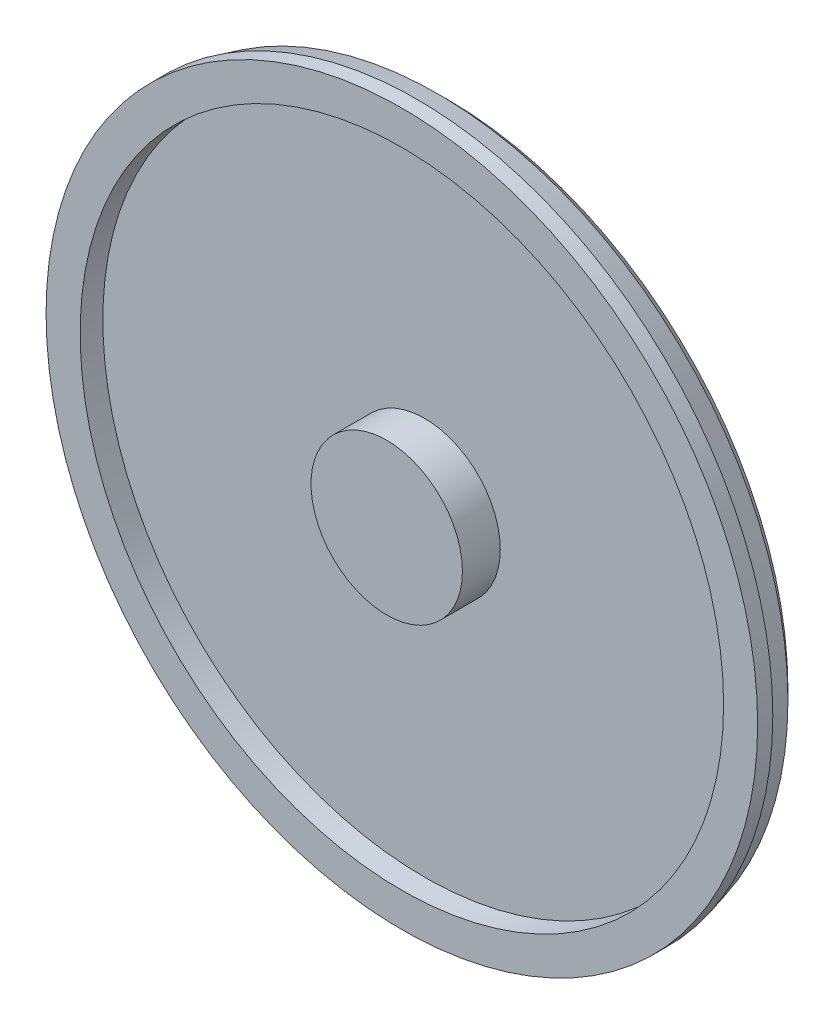
ISO-10303-21;
HEADER;
FILE_DESCRIPTION(('STEP AP214'),'2;1');
FILE_NAME('part.step','',(''),(''),'','','');
FILE_SCHEMA(('AUTOMOTIVE_DESIGN { 1 0 10303 214 1 1 1 1 }'));
ENDSEC;
DATA;
#1=APPLICATION_CONTEXT('core data for automotive mechanical design processes');
#2=APPLICATION_PROTOCOL_DEFINITION('international standard','automotive_design',2000,#1);
#3=PRODUCT_CONTEXT('',#1,'mechanical');
#4=PRODUCT('Part','Part','',(#3));
#5=PRODUCT_RELATED_PRODUCT_CATEGORY('part','',(#4));
#6=PRODUCT_DEFINITION_FORMATION('','',#4);
#7=PRODUCT_DEFINITION_CONTEXT('part definition',#1,'design');
#8=PRODUCT_DEFINITION('design','',#6,#7);
#9=PRODUCT_DEFINITION_SHAPE('','',#8);
#10=(LENGTH_UNIT() NAMED_UNIT(*) SI_UNIT(.MILLI.,.METRE.));
#11=(NAMED_UNIT(*) PLANE_ANGLE_UNIT() SI_UNIT($,.RADIAN.));
#12=(NAMED_UNIT(*) SI_UNIT($,.STERADIAN.) SOLID_ANGLE_UNIT());
#13=UNCERTAINTY_MEASURE_WITH_UNIT(LENGTH_MEASURE(1.E-05),#10,'distance_accuracy_value','');
#14=(GEOMETRIC_REPRESENTATION_CONTEXT(3) GLOBAL_UNCERTAINTY_ASSIGNED_CONTEXT((#13)) GLOBAL_UNIT_ASSIGNED_CONTEXT((#10,
#11,#12)) REPRESENTATION_CONTEXT('',''));
#15=CARTESIAN_POINT('',(0.,0.,0.));
#16=DIRECTION('',(0.,0.,1.));
#17=DIRECTION('',(1.,0.,0.));
#18=AXIS2_PLACEMENT_3D('',#15,#16,#17);
#19=CARTESIAN_POINT('',(0.,0.,60.));
#20=DIRECTION('',(0.,0.,-1.));
#21=DIRECTION('',(-1.,0.,0.));
#22=AXIS2_PLACEMENT_3D('',#19,#20,#21);
#23=CYLINDRICAL_SURFACE('',#22,470.);
#24=CARTESIAN_POINT('',(0.,0.,40.0000000000005));
#25=DIRECTION('',(0.,0.,-1.));
#26=DIRECTION('',(-1.,0.,0.));
#27=AXIS2_PLACEMENT_3D('',#24,#25,#26);
#28=CIRCLE('',#27,470.);
#29=CARTESIAN_POINT('',(-470.,0.,40.0000000000005));
#30=VERTEX_POINT('',#29);
#31=EDGE_CURVE('E55',#30,#30,#28,.F.);
#32=ORIENTED_EDGE('',*,*,#31,.T.);
#33=EDGE_LOOP('',(#32));
#34=FACE_BOUND('',#33,.T.);
#35=CARTESIAN_POINT('',(0.,0.,60.));
#36=DIRECTION('',(0.,0.,1.));
#37=DIRECTION('',(1.,0.,0.));
#38=AXIS2_PLACEMENT_3D('',#35,#36,#37);
#39=CIRCLE('',#38,470.);
#40=CARTESIAN_POINT('',(470.,0.,60.));
#41=VERTEX_POINT('',#40);
#42=EDGE_CURVE('E63',#41,#41,#39,.T.);
#43=ORIENTED_EDGE('',*,*,#42,.F.);
#44=EDGE_LOOP('',(#43));
#45=FACE_BOUND('',#44,.T.);
#46=ADVANCED_FACE('F47',(#34,#45),#23,.T.);
#47=CARTESIAN_POINT('',(0.,0.,60.));
#48=DIRECTION('',(0.,0.,1.));
#49=DIRECTION('',(1.,0.,0.));
#50=AXIS2_PLACEMENT_3D('',#47,#48,#49);
#51=PLANE('',#50);
#52=CARTESIAN_POINT('',(0.,0.,60.));
#53=DIRECTION('',(0.,0.,1.));
#54=DIRECTION('',(1.,0.,0.));
#55=AXIS2_PLACEMENT_3D('',#52,#53,#54);
#56=CIRCLE('',#55,425.);
#57=CARTESIAN_POINT('',(425.,0.,60.));
#58=VERTEX_POINT('',#57);
#59=EDGE_CURVE('E77',#58,#58,#56,.T.);
#60=ORIENTED_EDGE('',*,*,#59,.F.);
#61=EDGE_LOOP('',(#60));
#62=FACE_BOUND('',#61,.T.);
#63=ORIENTED_EDGE('',*,*,#42,.T.);
#64=EDGE_LOOP('',(#63));
#65=FACE_BOUND('',#64,.T.);
#66=ADVANCED_FACE('F83',(#62,#65),#51,.T.);
#67=CARTESIAN_POINT('',(0.,0.,0.));
#68=DIRECTION('',(0.,0.,1.));
#69=DIRECTION('',(1.,0.,0.));
#70=AXIS2_PLACEMENT_3D('',#67,#68,#69);
#71=PLANE('',#70);
#72=CARTESIAN_POINT('',(0.,0.,0.));
#73=DIRECTION('',(0.,0.,1.));
#74=DIRECTION('',(1.,0.,0.));
#75=AXIS2_PLACEMENT_3D('',#72,#73,#74);
#76=CIRCLE('',#75,450.);
#77=CARTESIAN_POINT('',(450.,0.,0.));
#78=VERTEX_POINT('',#77);
#79=EDGE_CURVE('E59',#78,#78,#76,.F.);
#80=ORIENTED_EDGE('',*,*,#79,.T.);
#81=EDGE_LOOP('',(#80));
#82=FACE_BOUND('',#81,.T.);
#83=ADVANCED_FACE('F86',(#82),#71,.F.);
#84=CARTESIAN_POINT('',(0.,0.,-1202.08152801713));
#85=DIRECTION('',(0.,0.,1.));
#86=DIRECTION('',(1.,0.,0.));
#87=AXIS2_PLACEMENT_3D('',#84,#85,#86);
#88=CYLINDRICAL_SURFACE('',#87,425.);
#89=CARTESIAN_POINT('',(0.,0.,30.));
#90=DIRECTION('',(0.,0.,1.));
#91=DIRECTION('',(1.,0.,0.));
#92=AXIS2_PLACEMENT_3D('',#89,#90,#91);
#93=CIRCLE('',#92,425.);
#94=CARTESIAN_POINT('',(425.,0.,30.));
#95=VERTEX_POINT('',#94);
#96=EDGE_CURVE('E71',#95,#95,#93,.F.);
#97=ORIENTED_EDGE('',*,*,#96,.T.);
#98=EDGE_LOOP('',(#97));
#99=FACE_BOUND('',#98,.T.);
#100=ORIENTED_EDGE('',*,*,#59,.T.);
#101=EDGE_LOOP('',(#100));
#102=FACE_BOUND('',#101,.T.);
#103=ADVANCED_FACE('F81',(#99,#102),#88,.F.);
#104=CARTESIAN_POINT('',(0.,0.,30.));
#105=DIRECTION('',(0.,0.,1.));
#106=DIRECTION('',(1.,0.,0.));
#107=AXIS2_PLACEMENT_3D('',#104,#105,#106);
#108=PLANE('',#107);
#109=CARTESIAN_POINT('',(0.,0.,30.));
#110=DIRECTION('',(0.,0.,1.));
#111=DIRECTION('',(1.,0.,0.));
#112=AXIS2_PLACEMENT_3D('',#109,#110,#111);
#113=CIRCLE('',#112,100.);
#114=CARTESIAN_POINT('',(100.,0.,30.));
#115=VERTEX_POINT('',#114);
#116=EDGE_CURVE('E74',#115,#115,#113,.T.);
#117=ORIENTED_EDGE('',*,*,#116,.F.);
#118=EDGE_LOOP('',(#117));
#119=FACE_BOUND('',#118,.T.);
#120=ORIENTED_EDGE('',*,*,#96,.F.);
#121=EDGE_LOOP('',(#120));
#122=FACE_BOUND('',#121,.T.);
#123=ADVANCED_FACE('F116',(#119,#122),#108,.T.);
#124=CARTESIAN_POINT('',(0.,0.,80.));
#125=DIRECTION('',(0.,0.,1.));
#126=DIRECTION('',(1.,0.,0.));
#127=AXIS2_PLACEMENT_3D('',#124,#125,#126);
#128=PLANE('',#127);
#129=CARTESIAN_POINT('',(0.,0.,80.));
#130=DIRECTION('',(0.,0.,1.));
#131=DIRECTION('',(1.,0.,0.));
#132=AXIS2_PLACEMENT_3D('',#129,#130,#131);
#133=CIRCLE('',#132,100.);
#134=CARTESIAN_POINT('',(100.,0.,80.));
#135=VERTEX_POINT('',#134);
#136=EDGE_CURVE('E68',#135,#135,#133,.T.);
#137=ORIENTED_EDGE('',*,*,#136,.T.);
#138=EDGE_LOOP('',(#137));
#139=FACE_BOUND('',#138,.T.);
#140=ADVANCED_FACE('F107',(#139),#128,.T.);
#141=CARTESIAN_POINT('',(0.,0.,80.));
#142=DIRECTION('',(0.,0.,-1.));
#143=DIRECTION('',(-1.,0.,0.));
#144=AXIS2_PLACEMENT_3D('',#141,#142,#143);
#145=CYLINDRICAL_SURFACE('',#144,100.);
#146=ORIENTED_EDGE('',*,*,#136,.F.);
#147=EDGE_LOOP('',(#146));
#148=FACE_BOUND('',#147,.T.);
#149=ORIENTED_EDGE('',*,*,#116,.T.);
#150=EDGE_LOOP('',(#149));
#151=FACE_BOUND('',#150,.T.);
#152=ADVANCED_FACE('F101',(#148,#151),#145,.T.);
#153=CARTESIAN_POINT('',(0.,0.,20.0000000000001));
#154=DIRECTION('',(0.,0.,1.));
#155=DIRECTION('',(1.,0.,0.));
#156=AXIS2_PLACEMENT_3D('',#153,#154,#155);
#157=CONICAL_SURFACE('',#156,470.,0.785398163397452);
#158=CARTESIAN_POINT('',(0.,0.,12.6794919243114));
#159=DIRECTION('',(0.,0.,1.));
#160=DIRECTION('',(1.,0.,0.));
#161=AXIS2_PLACEMENT_3D('',#158,#159,#160);
#162=CIRCLE('',#161,462.679491924311);
#163=CARTESIAN_POINT('',(462.679491924311,0.,12.6794919243114));
#164=VERTEX_POINT('',#163);
#165=EDGE_CURVE('E11',#164,#164,#162,.F.);
#166=ORIENTED_EDGE('',*,*,#165,.T.);
#167=EDGE_LOOP('',(#166));
#168=FACE_BOUND('',#167,.T.);
#169=ORIENTED_EDGE('',*,*,#79,.F.);
#170=EDGE_LOOP('',(#169));
#171=FACE_BOUND('',#170,.T.);
#172=ADVANCED_FACE('F98',(#168,#171),#157,.T.);
#173=CARTESIAN_POINT('',(0.,0.,40.0000000000005));
#174=DIRECTION('',(0.,0.,1.));
#175=DIRECTION('',(1.,0.,0.));
#176=AXIS2_PLACEMENT_3D('',#173,#174,#175);
#177=CONICAL_SURFACE('',#176,470.,0.261799387799145);
#178=ORIENTED_EDGE('',*,*,#165,.F.);
#179=EDGE_LOOP('',(#178));
#180=FACE_BOUND('',#179,.T.);
#181=ORIENTED_EDGE('',*,*,#31,.F.);
#182=EDGE_LOOP('',(#181));
#183=FACE_BOUND('',#182,.T.);
#184=ADVANCED_FACE('F50',(#180,#183),#177,.T.);
#185=CLOSED_SHELL('',(#46,#66,#83,#103,#123,#140,#152,#172,#184));
#186=MANIFOLD_SOLID_BREP('B2',#185);
#187=ADVANCED_BREP_SHAPE_REPRESENTATION('',(#18,#186),#14);
#188=SHAPE_DEFINITION_REPRESENTATION(#9,#187);
ENDSEC;
END-ISO-10303-21;
